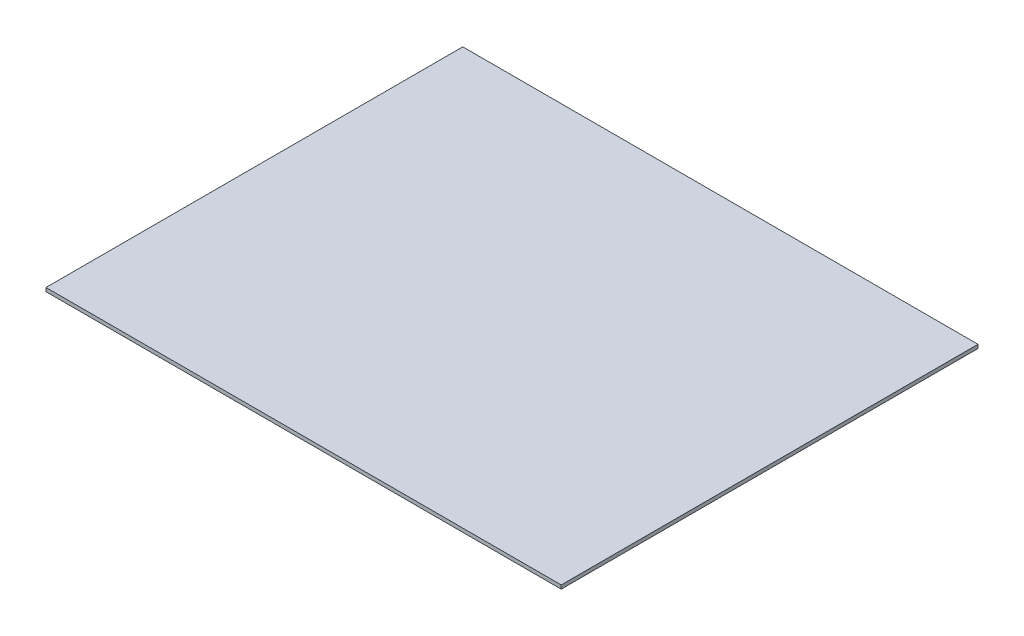
ISO-10303-21;
HEADER;
FILE_DESCRIPTION(('STEP AP214'),'2;1');
FILE_NAME('part.step','',(''),(''),'','','');
FILE_SCHEMA(('AUTOMOTIVE_DESIGN { 1 0 10303 214 1 1 1 1 }'));
ENDSEC;
DATA;
#1=APPLICATION_CONTEXT('core data for automotive mechanical design processes');
#2=APPLICATION_PROTOCOL_DEFINITION('international standard','automotive_design',2000,#1);
#3=PRODUCT_CONTEXT('',#1,'mechanical');
#4=PRODUCT('Part','Part','',(#3));
#5=PRODUCT_RELATED_PRODUCT_CATEGORY('part','',(#4));
#6=PRODUCT_DEFINITION_FORMATION('','',#4);
#7=PRODUCT_DEFINITION_CONTEXT('part definition',#1,'design');
#8=PRODUCT_DEFINITION('design','',#6,#7);
#9=PRODUCT_DEFINITION_SHAPE('','',#8);
#10=(LENGTH_UNIT() NAMED_UNIT(*) SI_UNIT(.MILLI.,.METRE.));
#11=(NAMED_UNIT(*) PLANE_ANGLE_UNIT() SI_UNIT($,.RADIAN.));
#12=(NAMED_UNIT(*) SI_UNIT($,.STERADIAN.) SOLID_ANGLE_UNIT());
#13=UNCERTAINTY_MEASURE_WITH_UNIT(LENGTH_MEASURE(1.E-05),#10,'distance_accuracy_value','');
#14=(GEOMETRIC_REPRESENTATION_CONTEXT(3) GLOBAL_UNCERTAINTY_ASSIGNED_CONTEXT((#13)) GLOBAL_UNIT_ASSIGNED_CONTEXT((#10,
#11,#12)) REPRESENTATION_CONTEXT('',''));
#15=CARTESIAN_POINT('',(0.,0.,0.));
#16=DIRECTION('',(0.,0.,1.));
#17=DIRECTION('',(1.,0.,0.));
#18=AXIS2_PLACEMENT_3D('',#15,#16,#17);
#19=CARTESIAN_POINT('',(-123.,1.75,-99.5));
#20=DIRECTION('',(1.,0.,0.));
#21=DIRECTION('',(0.,0.,-1.));
#22=AXIS2_PLACEMENT_3D('',#19,#20,#21);
#23=PLANE('',#22);
#24=DIRECTION('',(0.,0.,1.));
#25=VECTOR('',#24,1.);
#26=CARTESIAN_POINT('',(-123.,0.,-99.5));
#27=LINE('',#26,#25);
#28=CARTESIAN_POINT('',(-123.,0.,-99.5));
#29=VERTEX_POINT('',#28);
#30=CARTESIAN_POINT('',(-123.,0.,99.5));
#31=VERTEX_POINT('',#30);
#32=EDGE_CURVE('E96',#29,#31,#27,.T.);
#33=ORIENTED_EDGE('',*,*,#32,.T.);
#34=DIRECTION('',(0.,-1.,0.));
#35=VECTOR('',#34,1.);
#36=CARTESIAN_POINT('',(-123.,1.75,99.5));
#37=LINE('',#36,#35);
#38=CARTESIAN_POINT('',(-123.,1.75,99.5));
#39=VERTEX_POINT('',#38);
#40=EDGE_CURVE('E11',#39,#31,#37,.T.);
#41=ORIENTED_EDGE('',*,*,#40,.F.);
#42=DIRECTION('',(0.,0.,1.));
#43=VECTOR('',#42,1.);
#44=CARTESIAN_POINT('',(-123.,1.75,-99.5));
#45=LINE('',#44,#43);
#46=CARTESIAN_POINT('',(-123.,1.75,-99.5));
#47=VERTEX_POINT('',#46);
#48=EDGE_CURVE('E84',#47,#39,#45,.T.);
#49=ORIENTED_EDGE('',*,*,#48,.F.);
#50=DIRECTION('',(0.,-1.,0.));
#51=VECTOR('',#50,1.);
#52=CARTESIAN_POINT('',(-123.,1.75,-99.5));
#53=LINE('',#52,#51);
#54=EDGE_CURVE('E92',#47,#29,#53,.T.);
#55=ORIENTED_EDGE('',*,*,#54,.T.);
#56=EDGE_LOOP('',(#33,#41,#49,#55));
#57=FACE_BOUND('',#56,.T.);
#58=ADVANCED_FACE('F33',(#57),#23,.F.);
#59=CARTESIAN_POINT('',(123.,1.75,99.5));
#60=DIRECTION('',(0.,0.,-1.));
#61=DIRECTION('',(-1.,0.,0.));
#62=AXIS2_PLACEMENT_3D('',#59,#60,#61);
#63=PLANE('',#62);
#64=DIRECTION('',(1.,0.,0.));
#65=VECTOR('',#64,1.);
#66=CARTESIAN_POINT('',(123.,0.,99.5));
#67=LINE('',#66,#65);
#68=CARTESIAN_POINT('',(123.,0.,99.5));
#69=VERTEX_POINT('',#68);
#70=EDGE_CURVE('E88',#31,#69,#67,.T.);
#71=ORIENTED_EDGE('',*,*,#70,.T.);
#72=DIRECTION('',(0.,-1.,0.));
#73=VECTOR('',#72,1.);
#74=CARTESIAN_POINT('',(123.,1.75,99.5));
#75=LINE('',#74,#73);
#76=CARTESIAN_POINT('',(123.,1.75,99.5));
#77=VERTEX_POINT('',#76);
#78=EDGE_CURVE('E41',#77,#69,#75,.T.);
#79=ORIENTED_EDGE('',*,*,#78,.F.);
#80=DIRECTION('',(1.,0.,0.));
#81=VECTOR('',#80,1.);
#82=CARTESIAN_POINT('',(123.,1.75,99.5));
#83=LINE('',#82,#81);
#84=EDGE_CURVE('E79',#39,#77,#83,.T.);
#85=ORIENTED_EDGE('',*,*,#84,.F.);
#86=ORIENTED_EDGE('',*,*,#40,.T.);
#87=EDGE_LOOP('',(#71,#79,#85,#86));
#88=FACE_BOUND('',#87,.T.);
#89=ADVANCED_FACE('F87',(#88),#63,.F.);
#90=CARTESIAN_POINT('',(123.,1.75,-99.5));
#91=DIRECTION('',(-1.,0.,0.));
#92=DIRECTION('',(0.,0.,1.));
#93=AXIS2_PLACEMENT_3D('',#90,#91,#92);
#94=PLANE('',#93);
#95=DIRECTION('',(0.,0.,-1.));
#96=VECTOR('',#95,1.);
#97=CARTESIAN_POINT('',(123.,0.,-99.5));
#98=LINE('',#97,#96);
#99=CARTESIAN_POINT('',(123.,0.,-99.5));
#100=VERTEX_POINT('',#99);
#101=EDGE_CURVE('E66',#69,#100,#98,.T.);
#102=ORIENTED_EDGE('',*,*,#101,.T.);
#103=DIRECTION('',(0.,-1.,0.));
#104=VECTOR('',#103,1.);
#105=CARTESIAN_POINT('',(123.,1.75,-99.5));
#106=LINE('',#105,#104);
#107=CARTESIAN_POINT('',(123.,1.75,-99.5));
#108=VERTEX_POINT('',#107);
#109=EDGE_CURVE('E89',#108,#100,#106,.T.);
#110=ORIENTED_EDGE('',*,*,#109,.F.);
#111=DIRECTION('',(0.,0.,-1.));
#112=VECTOR('',#111,1.);
#113=CARTESIAN_POINT('',(123.,1.75,-99.5));
#114=LINE('',#113,#112);
#115=EDGE_CURVE('E82',#77,#108,#114,.T.);
#116=ORIENTED_EDGE('',*,*,#115,.F.);
#117=ORIENTED_EDGE('',*,*,#78,.T.);
#118=EDGE_LOOP('',(#102,#110,#116,#117));
#119=FACE_BOUND('',#118,.T.);
#120=ADVANCED_FACE('F90',(#119),#94,.F.);
#121=CARTESIAN_POINT('',(123.,1.75,-99.5));
#122=DIRECTION('',(0.,0.,1.));
#123=DIRECTION('',(1.,0.,0.));
#124=AXIS2_PLACEMENT_3D('',#121,#122,#123);
#125=PLANE('',#124);
#126=DIRECTION('',(-1.,0.,0.));
#127=VECTOR('',#126,1.);
#128=CARTESIAN_POINT('',(123.,0.,-99.5));
#129=LINE('',#128,#127);
#130=EDGE_CURVE('E72',#100,#29,#129,.T.);
#131=ORIENTED_EDGE('',*,*,#130,.T.);
#132=ORIENTED_EDGE('',*,*,#54,.F.);
#133=DIRECTION('',(-1.,0.,0.));
#134=VECTOR('',#133,1.);
#135=CARTESIAN_POINT('',(123.,1.75,-99.5));
#136=LINE('',#135,#134);
#137=EDGE_CURVE('E49',#108,#47,#136,.T.);
#138=ORIENTED_EDGE('',*,*,#137,.F.);
#139=ORIENTED_EDGE('',*,*,#109,.T.);
#140=EDGE_LOOP('',(#131,#132,#138,#139));
#141=FACE_BOUND('',#140,.T.);
#142=ADVANCED_FACE('F103',(#141),#125,.F.);
#143=CARTESIAN_POINT('',(0.,1.75,0.));
#144=DIRECTION('',(0.,-1.,0.));
#145=DIRECTION('',(0.,0.,-1.));
#146=AXIS2_PLACEMENT_3D('',#143,#144,#145);
#147=PLANE('',#146);
#148=ORIENTED_EDGE('',*,*,#48,.T.);
#149=ORIENTED_EDGE('',*,*,#84,.T.);
#150=ORIENTED_EDGE('',*,*,#115,.T.);
#151=ORIENTED_EDGE('',*,*,#137,.T.);
#152=EDGE_LOOP('',(#148,#149,#150,#151));
#153=FACE_BOUND('',#152,.T.);
#154=ADVANCED_FACE('F80',(#153),#147,.F.);
#155=CARTESIAN_POINT('',(0.,0.,0.));
#156=DIRECTION('',(0.,-1.,0.));
#157=DIRECTION('',(0.,0.,-1.));
#158=AXIS2_PLACEMENT_3D('',#155,#156,#157);
#159=PLANE('',#158);
#160=ORIENTED_EDGE('',*,*,#32,.F.);
#161=ORIENTED_EDGE('',*,*,#130,.F.);
#162=ORIENTED_EDGE('',*,*,#101,.F.);
#163=ORIENTED_EDGE('',*,*,#70,.F.);
#164=EDGE_LOOP('',(#160,#161,#162,#163));
#165=FACE_BOUND('',#164,.T.);
#166=ADVANCED_FACE('F106',(#165),#159,.T.);
#167=CLOSED_SHELL('',(#58,#89,#120,#142,#154,#166));
#168=MANIFOLD_SOLID_BREP('B2',#167);
#169=ADVANCED_BREP_SHAPE_REPRESENTATION('',(#18,#168),#14);
#170=SHAPE_DEFINITION_REPRESENTATION(#9,#169);
ENDSEC;
END-ISO-10303-21;
